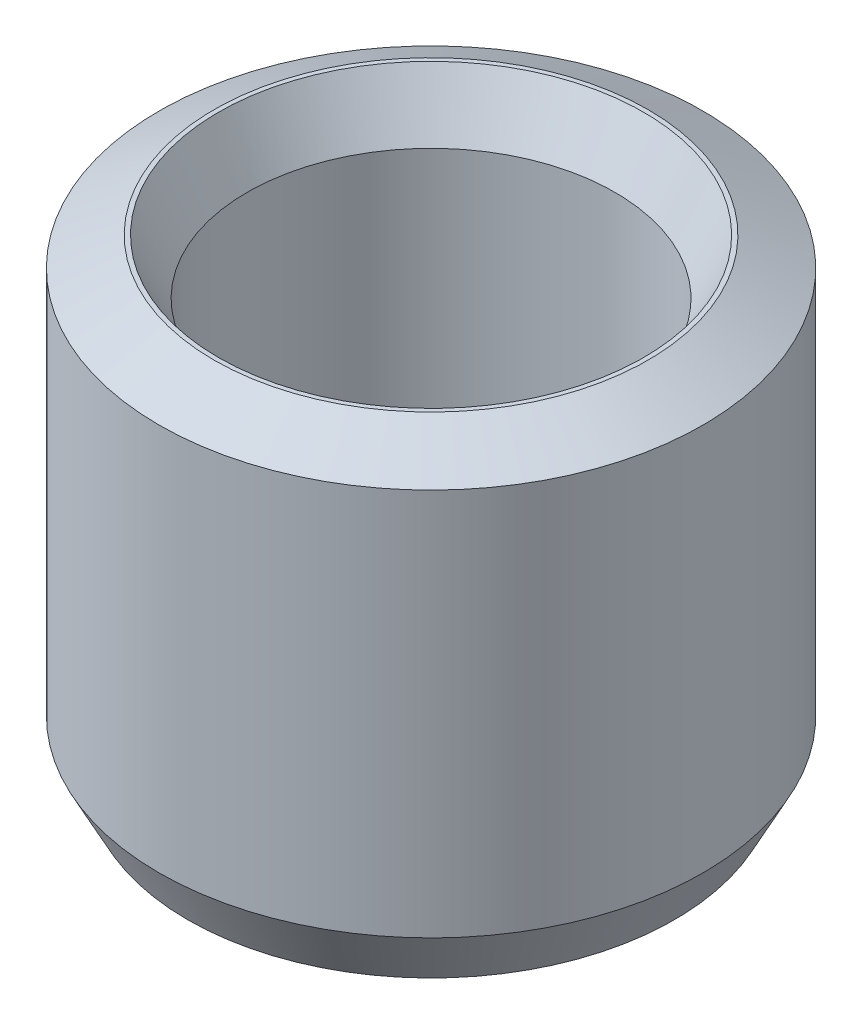
ISO-10303-21;
HEADER;
FILE_DESCRIPTION(('STEP AP214'),'2;1');
FILE_NAME('part.step','',(''),(''),'','','');
FILE_SCHEMA(('AUTOMOTIVE_DESIGN { 1 0 10303 214 1 1 1 1 }'));
ENDSEC;
DATA;
#1=APPLICATION_CONTEXT('core data for automotive mechanical design processes');
#2=APPLICATION_PROTOCOL_DEFINITION('international standard','automotive_design',2000,#1);
#3=PRODUCT_CONTEXT('',#1,'mechanical');
#4=PRODUCT('Part','Part','',(#3));
#5=PRODUCT_RELATED_PRODUCT_CATEGORY('part','',(#4));
#6=PRODUCT_DEFINITION_FORMATION('','',#4);
#7=PRODUCT_DEFINITION_CONTEXT('part definition',#1,'design');
#8=PRODUCT_DEFINITION('design','',#6,#7);
#9=PRODUCT_DEFINITION_SHAPE('','',#8);
#10=(LENGTH_UNIT() NAMED_UNIT(*) SI_UNIT(.MILLI.,.METRE.));
#11=(NAMED_UNIT(*) PLANE_ANGLE_UNIT() SI_UNIT($,.RADIAN.));
#12=(NAMED_UNIT(*) SI_UNIT($,.STERADIAN.) SOLID_ANGLE_UNIT());
#13=UNCERTAINTY_MEASURE_WITH_UNIT(LENGTH_MEASURE(1.E-05),#10,'distance_accuracy_value','');
#14=(GEOMETRIC_REPRESENTATION_CONTEXT(3) GLOBAL_UNCERTAINTY_ASSIGNED_CONTEXT((#13)) GLOBAL_UNIT_ASSIGNED_CONTEXT((#10,
#11,#12)) REPRESENTATION_CONTEXT('',''));
#15=CARTESIAN_POINT('',(0.,0.,0.));
#16=DIRECTION('',(0.,0.,1.));
#17=DIRECTION('',(1.,0.,0.));
#18=AXIS2_PLACEMENT_3D('',#15,#16,#17);
#19=CARTESIAN_POINT('',(0.,34.6713648814083,0.));
#20=DIRECTION('',(0.,-1.,0.));
#21=DIRECTION('',(0.,0.,-1.));
#22=AXIS2_PLACEMENT_3D('',#19,#20,#21);
#23=CYLINDRICAL_SURFACE('',#22,20.);
#24=CARTESIAN_POINT('',(0.,4.04503581699576,0.));
#25=DIRECTION('',(0.,1.,0.));
#26=DIRECTION('',(0.,0.,1.));
#27=AXIS2_PLACEMENT_3D('',#24,#25,#26);
#28=CIRCLE('',#27,20.);
#29=CARTESIAN_POINT('',(0.,4.04503581699576,20.));
#30=VERTEX_POINT('',#29);
#31=EDGE_CURVE('E10',#30,#30,#28,.T.);
#32=ORIENTED_EDGE('',*,*,#31,.T.);
#33=EDGE_LOOP('',(#32));
#34=FACE_BOUND('',#33,.T.);
#35=CARTESIAN_POINT('',(0.,32.5608104209832,0.));
#36=DIRECTION('',(0.,1.,0.));
#37=DIRECTION('',(0.,0.,1.));
#38=AXIS2_PLACEMENT_3D('',#35,#36,#37);
#39=CIRCLE('',#38,20.);
#40=CARTESIAN_POINT('',(0.,32.5608104209832,20.));
#41=VERTEX_POINT('',#40);
#42=EDGE_CURVE('E50',#41,#41,#39,.F.);
#43=ORIENTED_EDGE('',*,*,#42,.T.);
#44=EDGE_LOOP('',(#43));
#45=FACE_BOUND('',#44,.T.);
#46=ADVANCED_FACE('F39',(#34,#45),#23,.T.);
#47=CARTESIAN_POINT('',(0.,34.6713648814083,0.));
#48=DIRECTION('',(0.,1.,0.));
#49=DIRECTION('',(0.,0.,1.));
#50=AXIS2_PLACEMENT_3D('',#47,#48,#49);
#51=PLANE('',#50);
#52=CARTESIAN_POINT('',(0.,34.6713648814083,0.));
#53=DIRECTION('',(0.,1.,0.));
#54=DIRECTION('',(0.,0.,1.));
#55=AXIS2_PLACEMENT_3D('',#52,#53,#54);
#56=CIRCLE('',#55,15.628688140157);
#57=CARTESIAN_POINT('',(0.,34.6713648814083,15.628688140157));
#58=VERTEX_POINT('',#57);
#59=EDGE_CURVE('E58',#58,#58,#56,.F.);
#60=ORIENTED_EDGE('',*,*,#59,.T.);
#61=EDGE_LOOP('',(#60));
#62=FACE_BOUND('',#61,.T.);
#63=CARTESIAN_POINT('',(0.,34.6713648814083,0.));
#64=DIRECTION('',(0.,1.,0.));
#65=DIRECTION('',(0.,0.,1.));
#66=AXIS2_PLACEMENT_3D('',#63,#64,#65);
#67=CIRCLE('',#66,15.9549641830042);
#68=CARTESIAN_POINT('',(0.,34.6713648814083,15.9549641830042));
#69=VERTEX_POINT('',#68);
#70=EDGE_CURVE('E61',#69,#69,#67,.T.);
#71=ORIENTED_EDGE('',*,*,#70,.T.);
#72=EDGE_LOOP('',(#71));
#73=FACE_BOUND('',#72,.T.);
#74=ADVANCED_FACE('F88',(#62,#73),#51,.T.);
#75=CARTESIAN_POINT('',(0.,0.,0.));
#76=DIRECTION('',(0.,1.,0.));
#77=DIRECTION('',(0.,0.,1.));
#78=AXIS2_PLACEMENT_3D('',#75,#76,#77);
#79=PLANE('',#78);
#80=CARTESIAN_POINT('',(0.,0.,0.));
#81=DIRECTION('',(0.,1.,0.));
#82=DIRECTION('',(0.,0.,1.));
#83=AXIS2_PLACEMENT_3D('',#80,#81,#82);
#84=CIRCLE('',#83,17.5631694967276);
#85=CARTESIAN_POINT('',(0.,0.,17.5631694967276));
#86=VERTEX_POINT('',#85);
#87=EDGE_CURVE('E51',#86,#86,#84,.T.);
#88=ORIENTED_EDGE('',*,*,#87,.T.);
#89=EDGE_LOOP('',(#88));
#90=FACE_BOUND('',#89,.T.);
#91=CARTESIAN_POINT('',(0.,0.,0.));
#92=DIRECTION('',(0.,1.,0.));
#93=DIRECTION('',(0.,0.,1.));
#94=AXIS2_PLACEMENT_3D('',#91,#92,#93);
#95=CIRCLE('',#94,17.8894455395748);
#96=CARTESIAN_POINT('',(0.,0.,17.8894455395748));
#97=VERTEX_POINT('',#96);
#98=EDGE_CURVE('E54',#97,#97,#95,.F.);
#99=ORIENTED_EDGE('',*,*,#98,.T.);
#100=EDGE_LOOP('',(#99));
#101=FACE_BOUND('',#100,.T.);
#102=ADVANCED_FACE('F83',(#90,#101),#79,.F.);
#103=CARTESIAN_POINT('',(0.,34.6713648814083,0.));
#104=DIRECTION('',(0.,-1.,0.));
#105=DIRECTION('',(0.,0.,-1.));
#106=AXIS2_PLACEMENT_3D('',#103,#104,#105);
#107=CYLINDRICAL_SURFACE('',#106,13.5181336797318);
#108=CARTESIAN_POINT('',(0.,30.6263290644126,0.));
#109=DIRECTION('',(0.,1.,0.));
#110=DIRECTION('',(0.,0.,1.));
#111=AXIS2_PLACEMENT_3D('',#108,#109,#110);
#112=CIRCLE('',#111,13.5181336797318);
#113=CARTESIAN_POINT('',(0.,30.6263290644126,13.5181336797318));
#114=VERTEX_POINT('',#113);
#115=EDGE_CURVE('E67',#114,#114,#112,.T.);
#116=ORIENTED_EDGE('',*,*,#115,.T.);
#117=EDGE_LOOP('',(#116));
#118=FACE_BOUND('',#117,.T.);
#119=CARTESIAN_POINT('',(0.,2.11055446042517,0.));
#120=DIRECTION('',(0.,1.,0.));
#121=DIRECTION('',(0.,0.,1.));
#122=AXIS2_PLACEMENT_3D('',#119,#120,#121);
#123=CIRCLE('',#122,13.5181336797318);
#124=CARTESIAN_POINT('',(0.,2.11055446042517,13.5181336797318));
#125=VERTEX_POINT('',#124);
#126=EDGE_CURVE('E69',#125,#125,#123,.F.);
#127=ORIENTED_EDGE('',*,*,#126,.T.);
#128=EDGE_LOOP('',(#127));
#129=FACE_BOUND('',#128,.T.);
#130=ADVANCED_FACE('F71',(#118,#129),#107,.F.);
#131=CARTESIAN_POINT('',(0.,30.6263290644126,0.));
#132=DIRECTION('',(0.,1.,0.));
#133=DIRECTION('',(0.,0.,1.));
#134=AXIS2_PLACEMENT_3D('',#131,#132,#133);
#135=CONICAL_SURFACE('',#134,13.5181336797318,0.480906904538137);
#136=ORIENTED_EDGE('',*,*,#59,.F.);
#137=EDGE_LOOP('',(#136));
#138=FACE_BOUND('',#137,.T.);
#139=ORIENTED_EDGE('',*,*,#115,.F.);
#140=EDGE_LOOP('',(#139));
#141=FACE_BOUND('',#140,.T.);
#142=ADVANCED_FACE('F77',(#138,#141),#135,.F.);
#143=CARTESIAN_POINT('',(0.,0.,0.));
#144=DIRECTION('',(0.,-1.,0.));
#145=DIRECTION('',(0.,0.,-1.));
#146=AXIS2_PLACEMENT_3D('',#143,#144,#145);
#147=CONICAL_SURFACE('',#146,17.5631694967276,1.08988942225676);
#148=ORIENTED_EDGE('',*,*,#126,.F.);
#149=EDGE_LOOP('',(#148));
#150=FACE_BOUND('',#149,.T.);
#151=ORIENTED_EDGE('',*,*,#87,.F.);
#152=EDGE_LOOP('',(#151));
#153=FACE_BOUND('',#152,.T.);
#154=ADVANCED_FACE('F73',(#150,#153),#147,.F.);
#155=CARTESIAN_POINT('',(0.,4.04503581699576,0.));
#156=DIRECTION('',(0.,1.,0.));
#157=DIRECTION('',(0.,0.,1.));
#158=AXIS2_PLACEMENT_3D('',#155,#156,#157);
#159=CONICAL_SURFACE('',#158,20.,0.480906904538137);
#160=ORIENTED_EDGE('',*,*,#98,.F.);
#161=EDGE_LOOP('',(#160));
#162=FACE_BOUND('',#161,.T.);
#163=ORIENTED_EDGE('',*,*,#31,.F.);
#164=EDGE_LOOP('',(#163));
#165=FACE_BOUND('',#164,.T.);
#166=ADVANCED_FACE('F76',(#162,#165),#159,.T.);
#167=CARTESIAN_POINT('',(0.,34.6713648814083,0.));
#168=DIRECTION('',(0.,-1.,0.));
#169=DIRECTION('',(0.,0.,-1.));
#170=AXIS2_PLACEMENT_3D('',#167,#168,#169);
#171=CONICAL_SURFACE('',#170,15.9549641830042,1.08988942225676);
#172=ORIENTED_EDGE('',*,*,#42,.F.);
#173=EDGE_LOOP('',(#172));
#174=FACE_BOUND('',#173,.T.);
#175=ORIENTED_EDGE('',*,*,#70,.F.);
#176=EDGE_LOOP('',(#175));
#177=FACE_BOUND('',#176,.T.);
#178=ADVANCED_FACE('F45',(#174,#177),#171,.T.);
#179=CLOSED_SHELL('',(#46,#74,#102,#130,#142,#154,#166,#178));
#180=MANIFOLD_SOLID_BREP('B2',#179);
#181=ADVANCED_BREP_SHAPE_REPRESENTATION('',(#18,#180),#14);
#182=SHAPE_DEFINITION_REPRESENTATION(#9,#181);
ENDSEC;
END-ISO-10303-21;
